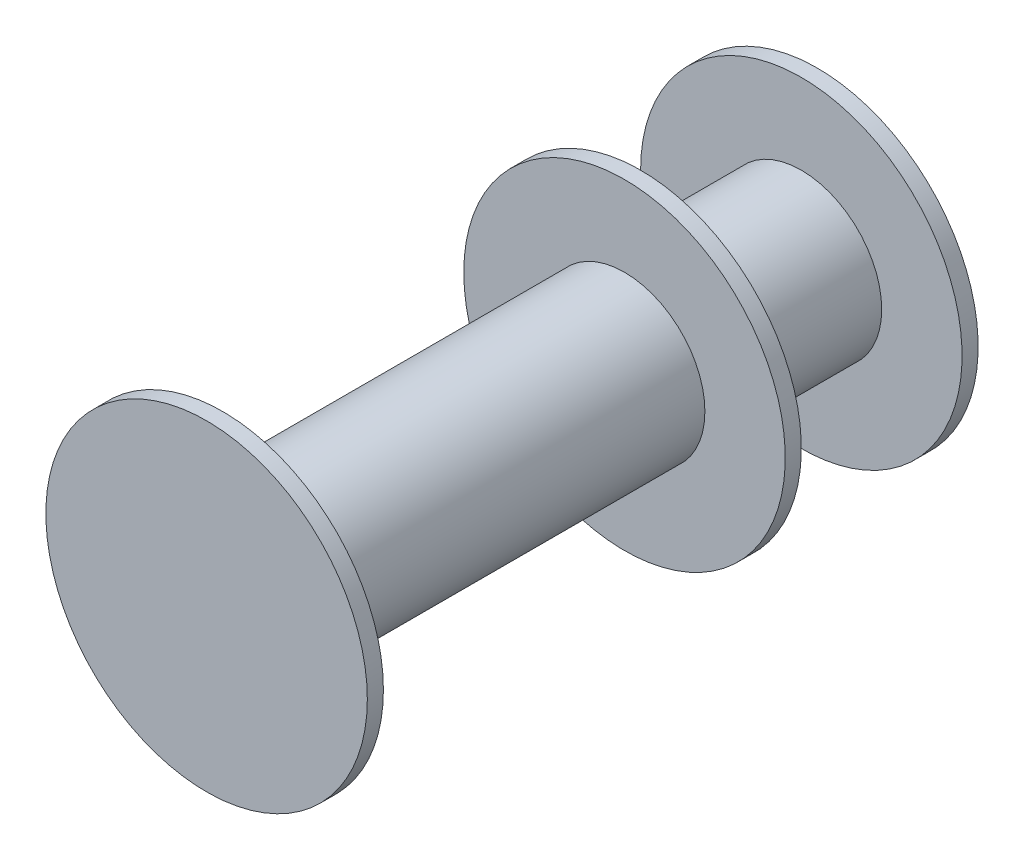
ISO-10303-21;
HEADER;
FILE_DESCRIPTION(('STEP AP214'),'2;1');
FILE_NAME('part.step','',(''),(''),'','','');
FILE_SCHEMA(('AUTOMOTIVE_DESIGN { 1 0 10303 214 1 1 1 1 }'));
ENDSEC;
DATA;
#1=APPLICATION_CONTEXT('core data for automotive mechanical design processes');
#2=APPLICATION_PROTOCOL_DEFINITION('international standard','automotive_design',2000,#1);
#3=PRODUCT_CONTEXT('',#1,'mechanical');
#4=PRODUCT('Part','Part','',(#3));
#5=PRODUCT_RELATED_PRODUCT_CATEGORY('part','',(#4));
#6=PRODUCT_DEFINITION_FORMATION('','',#4);
#7=PRODUCT_DEFINITION_CONTEXT('part definition',#1,'design');
#8=PRODUCT_DEFINITION('design','',#6,#7);
#9=PRODUCT_DEFINITION_SHAPE('','',#8);
#10=(LENGTH_UNIT() NAMED_UNIT(*) SI_UNIT(.MILLI.,.METRE.));
#11=(NAMED_UNIT(*) PLANE_ANGLE_UNIT() SI_UNIT($,.RADIAN.));
#12=(NAMED_UNIT(*) SI_UNIT($,.STERADIAN.) SOLID_ANGLE_UNIT());
#13=UNCERTAINTY_MEASURE_WITH_UNIT(LENGTH_MEASURE(1.E-05),#10,'distance_accuracy_value','');
#14=(GEOMETRIC_REPRESENTATION_CONTEXT(3) GLOBAL_UNCERTAINTY_ASSIGNED_CONTEXT((#13)) GLOBAL_UNIT_ASSIGNED_CONTEXT((#10,
#11,#12)) REPRESENTATION_CONTEXT('',''));
#15=CARTESIAN_POINT('',(0.,0.,0.));
#16=DIRECTION('',(0.,0.,1.));
#17=DIRECTION('',(1.,0.,0.));
#18=AXIS2_PLACEMENT_3D('',#15,#16,#17);
#19=CARTESIAN_POINT('',(0.,0.,12.5));
#20=DIRECTION('',(0.,0.,-1.));
#21=DIRECTION('',(-1.,0.,0.));
#22=AXIS2_PLACEMENT_3D('',#19,#20,#21);
#23=CYLINDRICAL_SURFACE('',#22,5.);
#24=CARTESIAN_POINT('',(0.,0.,12.5));
#25=DIRECTION('',(0.,0.,1.));
#26=DIRECTION('',(1.,0.,0.));
#27=AXIS2_PLACEMENT_3D('',#24,#25,#26);
#28=CIRCLE('',#27,5.);
#29=CARTESIAN_POINT('',(5.,0.,12.5));
#30=VERTEX_POINT('',#29);
#31=EDGE_CURVE('E10',#30,#30,#28,.T.);
#32=ORIENTED_EDGE('',*,*,#31,.F.);
#33=EDGE_LOOP('',(#32));
#34=FACE_BOUND('',#33,.T.);
#35=CARTESIAN_POINT('',(0.,0.,-12.5));
#36=DIRECTION('',(0.,0.,-1.));
#37=DIRECTION('',(-1.,0.,0.));
#38=AXIS2_PLACEMENT_3D('',#35,#36,#37);
#39=CIRCLE('',#38,5.);
#40=CARTESIAN_POINT('',(-5.,0.,-12.5));
#41=VERTEX_POINT('',#40);
#42=EDGE_CURVE('E50',#41,#41,#39,.T.);
#43=ORIENTED_EDGE('',*,*,#42,.F.);
#44=EDGE_LOOP('',(#43));
#45=FACE_BOUND('',#44,.T.);
#46=ADVANCED_FACE('F35',(#34,#45),#23,.T.);
#47=CARTESIAN_POINT('',(0.,0.,13.5));
#48=DIRECTION('',(0.,0.,-1.));
#49=DIRECTION('',(-1.,0.,0.));
#50=AXIS2_PLACEMENT_3D('',#47,#48,#49);
#51=CYLINDRICAL_SURFACE('',#50,10.);
#52=CARTESIAN_POINT('',(0.,0.,13.5));
#53=DIRECTION('',(0.,0.,1.));
#54=DIRECTION('',(1.,0.,0.));
#55=AXIS2_PLACEMENT_3D('',#52,#53,#54);
#56=CIRCLE('',#55,10.);
#57=CARTESIAN_POINT('',(10.,0.,13.5));
#58=VERTEX_POINT('',#57);
#59=EDGE_CURVE('E41',#58,#58,#56,.T.);
#60=ORIENTED_EDGE('',*,*,#59,.F.);
#61=EDGE_LOOP('',(#60));
#62=FACE_BOUND('',#61,.T.);
#63=CARTESIAN_POINT('',(0.,0.,12.5));
#64=DIRECTION('',(0.,0.,1.));
#65=DIRECTION('',(1.,0.,0.));
#66=AXIS2_PLACEMENT_3D('',#63,#64,#65);
#67=CIRCLE('',#66,10.);
#68=CARTESIAN_POINT('',(10.,0.,12.5));
#69=VERTEX_POINT('',#68);
#70=EDGE_CURVE('E45',#69,#69,#67,.T.);
#71=ORIENTED_EDGE('',*,*,#70,.T.);
#72=EDGE_LOOP('',(#71));
#73=FACE_BOUND('',#72,.T.);
#74=ADVANCED_FACE('F91',(#62,#73),#51,.T.);
#75=CARTESIAN_POINT('',(0.,0.,13.5));
#76=DIRECTION('',(0.,0.,1.));
#77=DIRECTION('',(1.,0.,0.));
#78=AXIS2_PLACEMENT_3D('',#75,#76,#77);
#79=PLANE('',#78);
#80=ORIENTED_EDGE('',*,*,#59,.T.);
#81=EDGE_LOOP('',(#80));
#82=FACE_BOUND('',#81,.T.);
#83=ADVANCED_FACE('F96',(#82),#79,.T.);
#84=CARTESIAN_POINT('',(0.,0.,12.5));
#85=DIRECTION('',(0.,0.,1.));
#86=DIRECTION('',(1.,0.,0.));
#87=AXIS2_PLACEMENT_3D('',#84,#85,#86);
#88=PLANE('',#87);
#89=ORIENTED_EDGE('',*,*,#31,.T.);
#90=EDGE_LOOP('',(#89));
#91=FACE_BOUND('',#90,.T.);
#92=ORIENTED_EDGE('',*,*,#70,.F.);
#93=EDGE_LOOP('',(#92));
#94=FACE_BOUND('',#93,.T.);
#95=ADVANCED_FACE('F110',(#91,#94),#88,.F.);
#96=CARTESIAN_POINT('',(0.,0.,-13.5));
#97=DIRECTION('',(0.,0.,1.));
#98=DIRECTION('',(1.,0.,0.));
#99=AXIS2_PLACEMENT_3D('',#96,#97,#98);
#100=CYLINDRICAL_SURFACE('',#99,10.);
#101=CARTESIAN_POINT('',(0.,0.,-13.5));
#102=DIRECTION('',(0.,0.,-1.));
#103=DIRECTION('',(-1.,0.,0.));
#104=AXIS2_PLACEMENT_3D('',#101,#102,#103);
#105=CIRCLE('',#104,10.);
#106=CARTESIAN_POINT('',(-10.,0.,-13.5));
#107=VERTEX_POINT('',#106);
#108=EDGE_CURVE('E54',#107,#107,#105,.T.);
#109=ORIENTED_EDGE('',*,*,#108,.F.);
#110=EDGE_LOOP('',(#109));
#111=FACE_BOUND('',#110,.T.);
#112=CARTESIAN_POINT('',(0.,0.,-12.5));
#113=DIRECTION('',(0.,0.,-1.));
#114=DIRECTION('',(-1.,0.,0.));
#115=AXIS2_PLACEMENT_3D('',#112,#113,#114);
#116=CIRCLE('',#115,10.);
#117=CARTESIAN_POINT('',(-10.,0.,-12.5));
#118=VERTEX_POINT('',#117);
#119=EDGE_CURVE('E55',#118,#118,#116,.T.);
#120=ORIENTED_EDGE('',*,*,#119,.T.);
#121=EDGE_LOOP('',(#120));
#122=FACE_BOUND('',#121,.T.);
#123=ADVANCED_FACE('F108',(#111,#122),#100,.T.);
#124=CARTESIAN_POINT('',(0.,0.,-13.5));
#125=DIRECTION('',(0.,0.,-1.));
#126=DIRECTION('',(-1.,0.,0.));
#127=AXIS2_PLACEMENT_3D('',#124,#125,#126);
#128=PLANE('',#127);
#129=CARTESIAN_POINT('',(0.,0.,-13.5));
#130=DIRECTION('',(0.,0.,-1.));
#131=DIRECTION('',(-1.,0.,0.));
#132=AXIS2_PLACEMENT_3D('',#129,#130,#131);
#133=CIRCLE('',#132,5.);
#134=CARTESIAN_POINT('',(-5.,0.,-13.5));
#135=VERTEX_POINT('',#134);
#136=EDGE_CURVE('E61',#135,#135,#133,.T.);
#137=ORIENTED_EDGE('',*,*,#136,.F.);
#138=EDGE_LOOP('',(#137));
#139=FACE_BOUND('',#138,.T.);
#140=ORIENTED_EDGE('',*,*,#108,.T.);
#141=EDGE_LOOP('',(#140));
#142=FACE_BOUND('',#141,.T.);
#143=ADVANCED_FACE('F104',(#139,#142),#128,.T.);
#144=CARTESIAN_POINT('',(0.,0.,-12.5));
#145=DIRECTION('',(0.,0.,-1.));
#146=DIRECTION('',(-1.,0.,0.));
#147=AXIS2_PLACEMENT_3D('',#144,#145,#146);
#148=PLANE('',#147);
#149=ORIENTED_EDGE('',*,*,#42,.T.);
#150=EDGE_LOOP('',(#149));
#151=FACE_BOUND('',#150,.T.);
#152=ORIENTED_EDGE('',*,*,#119,.F.);
#153=EDGE_LOOP('',(#152));
#154=FACE_BOUND('',#153,.T.);
#155=ADVANCED_FACE('F101',(#151,#154),#148,.F.);
#156=CARTESIAN_POINT('',(0.,0.,-23.5));
#157=DIRECTION('',(0.,0.,1.));
#158=DIRECTION('',(1.,0.,0.));
#159=AXIS2_PLACEMENT_3D('',#156,#157,#158);
#160=CYLINDRICAL_SURFACE('',#159,5.);
#161=CARTESIAN_POINT('',(0.,0.,-23.5));
#162=DIRECTION('',(0.,0.,-1.));
#163=DIRECTION('',(-1.,0.,0.));
#164=AXIS2_PLACEMENT_3D('',#161,#162,#163);
#165=CIRCLE('',#164,5.);
#166=CARTESIAN_POINT('',(-5.,0.,-23.5));
#167=VERTEX_POINT('',#166);
#168=EDGE_CURVE('E58',#167,#167,#165,.T.);
#169=ORIENTED_EDGE('',*,*,#168,.F.);
#170=EDGE_LOOP('',(#169));
#171=FACE_BOUND('',#170,.T.);
#172=ORIENTED_EDGE('',*,*,#136,.T.);
#173=EDGE_LOOP('',(#172));
#174=FACE_BOUND('',#173,.T.);
#175=ADVANCED_FACE('F78',(#171,#174),#160,.T.);
#176=CARTESIAN_POINT('',(0.,0.,-24.5));
#177=DIRECTION('',(0.,0.,1.));
#178=DIRECTION('',(1.,0.,0.));
#179=AXIS2_PLACEMENT_3D('',#176,#177,#178);
#180=CYLINDRICAL_SURFACE('',#179,10.);
#181=CARTESIAN_POINT('',(0.,0.,-24.5));
#182=DIRECTION('',(0.,0.,-1.));
#183=DIRECTION('',(-1.,0.,0.));
#184=AXIS2_PLACEMENT_3D('',#181,#182,#183);
#185=CIRCLE('',#184,10.);
#186=CARTESIAN_POINT('',(-10.,0.,-24.5));
#187=VERTEX_POINT('',#186);
#188=EDGE_CURVE('E64',#187,#187,#185,.T.);
#189=ORIENTED_EDGE('',*,*,#188,.F.);
#190=EDGE_LOOP('',(#189));
#191=FACE_BOUND('',#190,.T.);
#192=CARTESIAN_POINT('',(0.,0.,-23.5));
#193=DIRECTION('',(0.,0.,-1.));
#194=DIRECTION('',(-1.,0.,0.));
#195=AXIS2_PLACEMENT_3D('',#192,#193,#194);
#196=CIRCLE('',#195,10.);
#197=CARTESIAN_POINT('',(-10.,0.,-23.5));
#198=VERTEX_POINT('',#197);
#199=EDGE_CURVE('E67',#198,#198,#196,.T.);
#200=ORIENTED_EDGE('',*,*,#199,.T.);
#201=EDGE_LOOP('',(#200));
#202=FACE_BOUND('',#201,.T.);
#203=ADVANCED_FACE('F75',(#191,#202),#180,.T.);
#204=CARTESIAN_POINT('',(0.,0.,-24.5));
#205=DIRECTION('',(0.,0.,-1.));
#206=DIRECTION('',(-1.,0.,0.));
#207=AXIS2_PLACEMENT_3D('',#204,#205,#206);
#208=PLANE('',#207);
#209=ORIENTED_EDGE('',*,*,#188,.T.);
#210=EDGE_LOOP('',(#209));
#211=FACE_BOUND('',#210,.T.);
#212=ADVANCED_FACE('F73',(#211),#208,.T.);
#213=CARTESIAN_POINT('',(0.,0.,-23.5));
#214=DIRECTION('',(0.,0.,-1.));
#215=DIRECTION('',(-1.,0.,0.));
#216=AXIS2_PLACEMENT_3D('',#213,#214,#215);
#217=PLANE('',#216);
#218=ORIENTED_EDGE('',*,*,#168,.T.);
#219=EDGE_LOOP('',(#218));
#220=FACE_BOUND('',#219,.T.);
#221=ORIENTED_EDGE('',*,*,#199,.F.);
#222=EDGE_LOOP('',(#221));
#223=FACE_BOUND('',#222,.T.);
#224=ADVANCED_FACE('F82',(#220,#223),#217,.F.);
#225=CLOSED_SHELL('',(#46,#74,#83,#95,#123,#143,#155,#175,#203,#212,#224));
#226=MANIFOLD_SOLID_BREP('B2',#225);
#227=ADVANCED_BREP_SHAPE_REPRESENTATION('',(#18,#226),#14);
#228=SHAPE_DEFINITION_REPRESENTATION(#9,#227);
ENDSEC;
END-ISO-10303-21;
